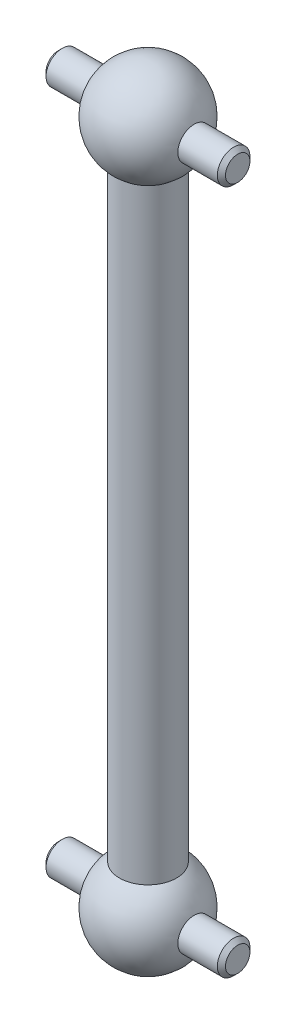
ISO-10303-21;
HEADER;
FILE_DESCRIPTION(('STEP AP214'),'2;1');
FILE_NAME('part.step','',(''),(''),'','','');
FILE_SCHEMA(('AUTOMOTIVE_DESIGN { 1 0 10303 214 1 1 1 1 }'));
ENDSEC;
DATA;
#1=APPLICATION_CONTEXT('core data for automotive mechanical design processes');
#2=APPLICATION_PROTOCOL_DEFINITION('international standard','automotive_design',2000,#1);
#3=PRODUCT_CONTEXT('',#1,'mechanical');
#4=PRODUCT('Part','Part','',(#3));
#5=PRODUCT_RELATED_PRODUCT_CATEGORY('part','',(#4));
#6=PRODUCT_DEFINITION_FORMATION('','',#4);
#7=PRODUCT_DEFINITION_CONTEXT('part definition',#1,'design');
#8=PRODUCT_DEFINITION('design','',#6,#7);
#9=PRODUCT_DEFINITION_SHAPE('','',#8);
#10=(LENGTH_UNIT() NAMED_UNIT(*) SI_UNIT(.MILLI.,.METRE.));
#11=(NAMED_UNIT(*) PLANE_ANGLE_UNIT() SI_UNIT($,.RADIAN.));
#12=(NAMED_UNIT(*) SI_UNIT($,.STERADIAN.) SOLID_ANGLE_UNIT());
#13=UNCERTAINTY_MEASURE_WITH_UNIT(LENGTH_MEASURE(1.E-05),#10,'distance_accuracy_value','');
#14=(GEOMETRIC_REPRESENTATION_CONTEXT(3) GLOBAL_UNCERTAINTY_ASSIGNED_CONTEXT((#13)) GLOBAL_UNIT_ASSIGNED_CONTEXT((#10,
#11,#12)) REPRESENTATION_CONTEXT('',''));
#15=CARTESIAN_POINT('',(0.,0.,0.));
#16=DIRECTION('',(0.,0.,1.));
#17=DIRECTION('',(1.,0.,0.));
#18=AXIS2_PLACEMENT_3D('',#15,#16,#17);
#19=CARTESIAN_POINT('',(0.,42.,0.));
#20=DIRECTION('',(0.,-1.,0.));
#21=DIRECTION('',(1.,0.,0.));
#22=AXIS2_PLACEMENT_3D('',#19,#20,#21);
#23=SPHERICAL_SURFACE('',#22,3.);
#24=CARTESIAN_POINT('',(2.82842712474619,42.,0.));
#25=DIRECTION('',(-1.,0.,0.));
#26=DIRECTION('',(0.,0.,1.));
#27=AXIS2_PLACEMENT_3D('',#24,#25,#26);
#28=CIRCLE('',#27,1.);
#29=CARTESIAN_POINT('',(2.82842712474619,42.,1.));
#30=VERTEX_POINT('',#29);
#31=EDGE_CURVE('E65',#30,#30,#28,.T.);
#32=ORIENTED_EDGE('',*,*,#31,.T.);
#33=EDGE_LOOP('',(#32));
#34=FACE_BOUND('',#33,.T.);
#35=CARTESIAN_POINT('',(0.,39.5633014137978,0.));
#36=DIRECTION('',(0.,-1.,0.));
#37=DIRECTION('',(1.,0.,0.));
#38=AXIS2_PLACEMENT_3D('',#35,#36,#37);
#39=CIRCLE('',#38,1.75);
#40=CARTESIAN_POINT('',(1.75,39.5633014137978,0.));
#41=VERTEX_POINT('',#40);
#42=EDGE_CURVE('E71',#41,#41,#39,.T.);
#43=ORIENTED_EDGE('',*,*,#42,.F.);
#44=EDGE_LOOP('',(#43));
#45=FACE_BOUND('',#44,.T.);
#46=CARTESIAN_POINT('',(-2.82842712474619,42.,0.));
#47=DIRECTION('',(1.,0.,0.));
#48=DIRECTION('',(0.,0.,-1.));
#49=AXIS2_PLACEMENT_3D('',#46,#47,#48);
#50=CIRCLE('',#49,1.);
#51=CARTESIAN_POINT('',(-2.82842712474619,42.,-1.));
#52=VERTEX_POINT('',#51);
#53=EDGE_CURVE('E61',#52,#52,#50,.T.);
#54=ORIENTED_EDGE('',*,*,#53,.T.);
#55=EDGE_LOOP('',(#54));
#56=FACE_BOUND('',#55,.T.);
#57=ADVANCED_FACE('F29',(#34,#45,#56),#23,.T.);
#58=CARTESIAN_POINT('',(0.,0.,0.));
#59=DIRECTION('',(0.,-1.,0.));
#60=DIRECTION('',(1.,0.,0.));
#61=AXIS2_PLACEMENT_3D('',#58,#59,#60);
#62=SPHERICAL_SURFACE('',#61,3.);
#63=CARTESIAN_POINT('',(2.82842712474619,0.,0.));
#64=DIRECTION('',(-1.,0.,0.));
#65=DIRECTION('',(0.,0.,1.));
#66=AXIS2_PLACEMENT_3D('',#63,#64,#65);
#67=CIRCLE('',#66,1.);
#68=CARTESIAN_POINT('',(2.82842712474619,0.,1.));
#69=VERTEX_POINT('',#68);
#70=EDGE_CURVE('E64',#69,#69,#67,.T.);
#71=ORIENTED_EDGE('',*,*,#70,.T.);
#72=EDGE_LOOP('',(#71));
#73=FACE_BOUND('',#72,.T.);
#74=CARTESIAN_POINT('',(0.,2.43669858620224,0.));
#75=DIRECTION('',(0.,-1.,0.));
#76=DIRECTION('',(1.,0.,0.));
#77=AXIS2_PLACEMENT_3D('',#74,#75,#76);
#78=CIRCLE('',#77,1.75000000000001);
#79=CARTESIAN_POINT('',(1.75000000000001,2.43669858620224,0.));
#80=VERTEX_POINT('',#79);
#81=EDGE_CURVE('E60',#80,#80,#78,.T.);
#82=ORIENTED_EDGE('',*,*,#81,.T.);
#83=EDGE_LOOP('',(#82));
#84=FACE_BOUND('',#83,.T.);
#85=CARTESIAN_POINT('',(-2.82842712474619,0.,0.));
#86=DIRECTION('',(1.,0.,0.));
#87=DIRECTION('',(0.,0.,-1.));
#88=AXIS2_PLACEMENT_3D('',#85,#86,#87);
#89=CIRCLE('',#88,1.);
#90=CARTESIAN_POINT('',(-2.82842712474619,0.,-1.));
#91=VERTEX_POINT('',#90);
#92=EDGE_CURVE('E68',#91,#91,#89,.T.);
#93=ORIENTED_EDGE('',*,*,#92,.T.);
#94=EDGE_LOOP('',(#93));
#95=FACE_BOUND('',#94,.T.);
#96=ADVANCED_FACE('F84',(#73,#84,#95),#62,.T.);
#97=CARTESIAN_POINT('',(0.,-3.,0.));
#98=DIRECTION('',(0.,-1.,0.));
#99=DIRECTION('',(1.,0.,0.));
#100=AXIS2_PLACEMENT_3D('',#97,#98,#99);
#101=CYLINDRICAL_SURFACE('',#100,1.75);
#102=ORIENTED_EDGE('',*,*,#42,.T.);
#103=EDGE_LOOP('',(#102));
#104=FACE_BOUND('',#103,.T.);
#105=ORIENTED_EDGE('',*,*,#81,.F.);
#106=EDGE_LOOP('',(#105));
#107=FACE_BOUND('',#106,.T.);
#108=ADVANCED_FACE('F79',(#104,#107),#101,.T.);
#109=CARTESIAN_POINT('',(5.5,0.,0.));
#110=DIRECTION('',(1.,0.,0.));
#111=DIRECTION('',(0.,0.,-1.));
#112=AXIS2_PLACEMENT_3D('',#109,#110,#111);
#113=PLANE('',#112);
#114=CARTESIAN_POINT('',(5.5,0.,0.));
#115=DIRECTION('',(1.,0.,0.));
#116=DIRECTION('',(0.,0.,-1.));
#117=AXIS2_PLACEMENT_3D('',#114,#115,#116);
#118=CIRCLE('',#117,0.749999999999996);
#119=CARTESIAN_POINT('',(5.5,0.,-0.749999999999996));
#120=VERTEX_POINT('',#119);
#121=EDGE_CURVE('E51',#120,#120,#118,.T.);
#122=ORIENTED_EDGE('',*,*,#121,.T.);
#123=EDGE_LOOP('',(#122));
#124=FACE_BOUND('',#123,.T.);
#125=ADVANCED_FACE('F108',(#124),#113,.T.);
#126=CARTESIAN_POINT('',(5.5,0.,0.));
#127=DIRECTION('',(-1.,0.,0.));
#128=DIRECTION('',(0.,0.,1.));
#129=AXIS2_PLACEMENT_3D('',#126,#127,#128);
#130=CYLINDRICAL_SURFACE('',#129,1.);
#131=CARTESIAN_POINT('',(5.25,0.,0.));
#132=DIRECTION('',(1.,0.,0.));
#133=DIRECTION('',(0.,0.,-1.));
#134=AXIS2_PLACEMENT_3D('',#131,#132,#133);
#135=CIRCLE('',#134,1.);
#136=CARTESIAN_POINT('',(5.25,0.,-1.));
#137=VERTEX_POINT('',#136);
#138=EDGE_CURVE('E48',#137,#137,#135,.F.);
#139=ORIENTED_EDGE('',*,*,#138,.T.);
#140=EDGE_LOOP('',(#139));
#141=FACE_BOUND('',#140,.T.);
#142=ORIENTED_EDGE('',*,*,#70,.F.);
#143=EDGE_LOOP('',(#142));
#144=FACE_BOUND('',#143,.T.);
#145=ADVANCED_FACE('F111',(#141,#144),#130,.T.);
#146=CARTESIAN_POINT('',(-5.25,0.,0.));
#147=DIRECTION('',(1.,0.,0.));
#148=DIRECTION('',(0.,0.,-1.));
#149=AXIS2_PLACEMENT_3D('',#146,#147,#148);
#150=CIRCLE('',#149,1.);
#151=CARTESIAN_POINT('',(-5.25,0.,-1.));
#152=VERTEX_POINT('',#151);
#153=EDGE_CURVE('E57',#152,#152,#150,.T.);
#154=ORIENTED_EDGE('',*,*,#153,.T.);
#155=EDGE_LOOP('',(#154));
#156=FACE_BOUND('',#155,.T.);
#157=ORIENTED_EDGE('',*,*,#92,.F.);
#158=EDGE_LOOP('',(#157));
#159=FACE_BOUND('',#158,.T.);
#160=ADVANCED_FACE('F106',(#156,#159),#130,.T.);
#161=CARTESIAN_POINT('',(-5.5,0.,0.));
#162=DIRECTION('',(1.,0.,0.));
#163=DIRECTION('',(0.,0.,-1.));
#164=AXIS2_PLACEMENT_3D('',#161,#162,#163);
#165=PLANE('',#164);
#166=CARTESIAN_POINT('',(-5.5,0.,0.));
#167=DIRECTION('',(1.,0.,0.));
#168=DIRECTION('',(0.,0.,-1.));
#169=AXIS2_PLACEMENT_3D('',#166,#167,#168);
#170=CIRCLE('',#169,0.749999999999998);
#171=CARTESIAN_POINT('',(-5.5,0.,-0.749999999999998));
#172=VERTEX_POINT('',#171);
#173=EDGE_CURVE('E54',#172,#172,#170,.F.);
#174=ORIENTED_EDGE('',*,*,#173,.T.);
#175=EDGE_LOOP('',(#174));
#176=FACE_BOUND('',#175,.T.);
#177=ADVANCED_FACE('F103',(#176),#165,.F.);
#178=CARTESIAN_POINT('',(5.5,42.,0.));
#179=DIRECTION('',(1.,0.,0.));
#180=DIRECTION('',(0.,0.,-1.));
#181=AXIS2_PLACEMENT_3D('',#178,#179,#180);
#182=PLANE('',#181);
#183=CARTESIAN_POINT('',(5.5,42.,0.));
#184=DIRECTION('',(1.,0.,0.));
#185=DIRECTION('',(0.,0.,-1.));
#186=AXIS2_PLACEMENT_3D('',#183,#184,#185);
#187=CIRCLE('',#186,0.749999999999997);
#188=CARTESIAN_POINT('',(5.5,42.,-0.749999999999997));
#189=VERTEX_POINT('',#188);
#190=EDGE_CURVE('E43',#189,#189,#187,.T.);
#191=ORIENTED_EDGE('',*,*,#190,.T.);
#192=EDGE_LOOP('',(#191));
#193=FACE_BOUND('',#192,.T.);
#194=ADVANCED_FACE('F99',(#193),#182,.T.);
#195=CARTESIAN_POINT('',(5.5,42.,0.));
#196=DIRECTION('',(-1.,0.,0.));
#197=DIRECTION('',(0.,0.,1.));
#198=AXIS2_PLACEMENT_3D('',#195,#196,#197);
#199=CYLINDRICAL_SURFACE('',#198,1.);
#200=CARTESIAN_POINT('',(5.25,42.,0.));
#201=DIRECTION('',(1.,0.,0.));
#202=DIRECTION('',(0.,0.,-1.));
#203=AXIS2_PLACEMENT_3D('',#200,#201,#202);
#204=CIRCLE('',#203,1.);
#205=CARTESIAN_POINT('',(5.25,42.,-1.));
#206=VERTEX_POINT('',#205);
#207=EDGE_CURVE('E39',#206,#206,#204,.F.);
#208=ORIENTED_EDGE('',*,*,#207,.T.);
#209=EDGE_LOOP('',(#208));
#210=FACE_BOUND('',#209,.T.);
#211=ORIENTED_EDGE('',*,*,#31,.F.);
#212=EDGE_LOOP('',(#211));
#213=FACE_BOUND('',#212,.T.);
#214=ADVANCED_FACE('F91',(#210,#213),#199,.T.);
#215=CARTESIAN_POINT('',(-5.25,42.,0.));
#216=DIRECTION('',(1.,0.,0.));
#217=DIRECTION('',(0.,0.,-1.));
#218=AXIS2_PLACEMENT_3D('',#215,#216,#217);
#219=CIRCLE('',#218,1.);
#220=CARTESIAN_POINT('',(-5.25,42.,-1.));
#221=VERTEX_POINT('',#220);
#222=EDGE_CURVE('E35',#221,#221,#219,.T.);
#223=ORIENTED_EDGE('',*,*,#222,.T.);
#224=EDGE_LOOP('',(#223));
#225=FACE_BOUND('',#224,.T.);
#226=ORIENTED_EDGE('',*,*,#53,.F.);
#227=EDGE_LOOP('',(#226));
#228=FACE_BOUND('',#227,.T.);
#229=ADVANCED_FACE('F88',(#225,#228),#199,.T.);
#230=CARTESIAN_POINT('',(-5.5,42.,0.));
#231=DIRECTION('',(1.,0.,0.));
#232=DIRECTION('',(0.,0.,-1.));
#233=AXIS2_PLACEMENT_3D('',#230,#231,#232);
#234=PLANE('',#233);
#235=CARTESIAN_POINT('',(-5.5,42.,0.));
#236=DIRECTION('',(1.,0.,0.));
#237=DIRECTION('',(0.,0.,-1.));
#238=AXIS2_PLACEMENT_3D('',#235,#236,#237);
#239=CIRCLE('',#238,0.75);
#240=CARTESIAN_POINT('',(-5.5,42.,-0.75));
#241=VERTEX_POINT('',#240);
#242=EDGE_CURVE('E10',#241,#241,#239,.F.);
#243=ORIENTED_EDGE('',*,*,#242,.T.);
#244=EDGE_LOOP('',(#243));
#245=FACE_BOUND('',#244,.T.);
#246=ADVANCED_FACE('F90',(#245),#234,.F.);
#247=CARTESIAN_POINT('',(-5.25,0.,0.));
#248=DIRECTION('',(1.,0.,0.));
#249=DIRECTION('',(0.,0.,-1.));
#250=AXIS2_PLACEMENT_3D('',#247,#248,#249);
#251=CONICAL_SURFACE('',#250,1.,0.785398163397445);
#252=ORIENTED_EDGE('',*,*,#173,.F.);
#253=EDGE_LOOP('',(#252));
#254=FACE_BOUND('',#253,.T.);
#255=ORIENTED_EDGE('',*,*,#153,.F.);
#256=EDGE_LOOP('',(#255));
#257=FACE_BOUND('',#256,.T.);
#258=ADVANCED_FACE('F97',(#254,#257),#251,.T.);
#259=CARTESIAN_POINT('',(5.5,0.,0.));
#260=DIRECTION('',(-1.,0.,0.));
#261=DIRECTION('',(0.,0.,1.));
#262=AXIS2_PLACEMENT_3D('',#259,#260,#261);
#263=CONICAL_SURFACE('',#262,0.749999999999996,0.785398163397453);
#264=ORIENTED_EDGE('',*,*,#138,.F.);
#265=EDGE_LOOP('',(#264));
#266=FACE_BOUND('',#265,.T.);
#267=ORIENTED_EDGE('',*,*,#121,.F.);
#268=EDGE_LOOP('',(#267));
#269=FACE_BOUND('',#268,.T.);
#270=ADVANCED_FACE('F134',(#266,#269),#263,.T.);
#271=CARTESIAN_POINT('',(5.5,42.,0.));
#272=DIRECTION('',(-1.,0.,0.));
#273=DIRECTION('',(0.,0.,1.));
#274=AXIS2_PLACEMENT_3D('',#271,#272,#273);
#275=CONICAL_SURFACE('',#274,0.749999999999997,0.785398163397453);
#276=ORIENTED_EDGE('',*,*,#207,.F.);
#277=EDGE_LOOP('',(#276));
#278=FACE_BOUND('',#277,.T.);
#279=ORIENTED_EDGE('',*,*,#190,.F.);
#280=EDGE_LOOP('',(#279));
#281=FACE_BOUND('',#280,.T.);
#282=ADVANCED_FACE('F140',(#278,#281),#275,.T.);
#283=CARTESIAN_POINT('',(-5.25,42.,0.));
#284=DIRECTION('',(1.,0.,0.));
#285=DIRECTION('',(0.,0.,-1.));
#286=AXIS2_PLACEMENT_3D('',#283,#284,#285);
#287=CONICAL_SURFACE('',#286,1.,0.785398163397445);
#288=ORIENTED_EDGE('',*,*,#242,.F.);
#289=EDGE_LOOP('',(#288));
#290=FACE_BOUND('',#289,.T.);
#291=ORIENTED_EDGE('',*,*,#222,.F.);
#292=EDGE_LOOP('',(#291));
#293=FACE_BOUND('',#292,.T.);
#294=ADVANCED_FACE('F147',(#290,#293),#287,.T.);
#295=CLOSED_SHELL('',(#57,#96,#108,#125,#145,#160,#177,#194,#214,#229,#246,#258,#270,#282,#294));
#296=MANIFOLD_SOLID_BREP('B2',#295);
#297=ADVANCED_BREP_SHAPE_REPRESENTATION('',(#18,#296),#14);
#298=SHAPE_DEFINITION_REPRESENTATION(#9,#297);
ENDSEC;
END-ISO-10303-21;
